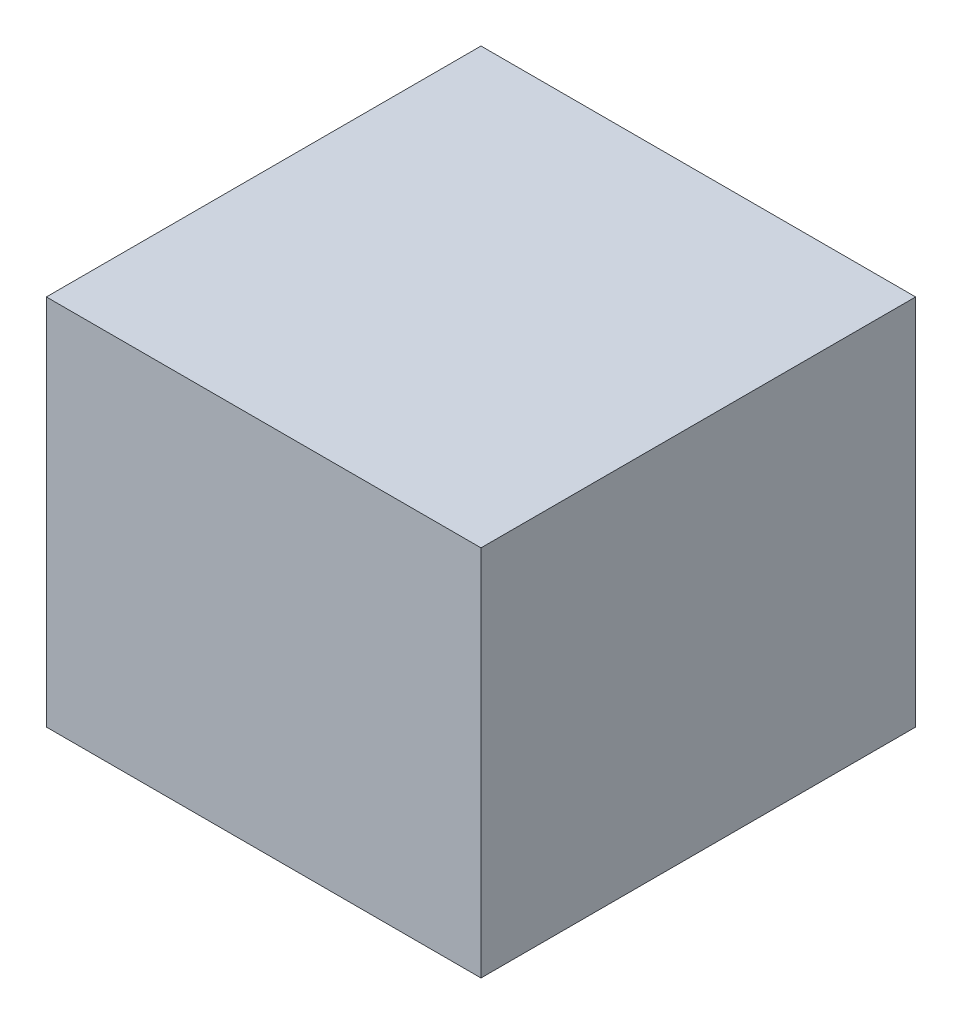
ISO-10303-21;
HEADER;
FILE_DESCRIPTION(('STEP AP214'),'2;1');
FILE_NAME('part.step','',(''),(''),'','','');
FILE_SCHEMA(('AUTOMOTIVE_DESIGN { 1 0 10303 214 1 1 1 1 }'));
ENDSEC;
DATA;
#1=APPLICATION_CONTEXT('core data for automotive mechanical design processes');
#2=APPLICATION_PROTOCOL_DEFINITION('international standard','automotive_design',2000,#1);
#3=PRODUCT_CONTEXT('',#1,'mechanical');
#4=PRODUCT('Part','Part','',(#3));
#5=PRODUCT_RELATED_PRODUCT_CATEGORY('part','',(#4));
#6=PRODUCT_DEFINITION_FORMATION('','',#4);
#7=PRODUCT_DEFINITION_CONTEXT('part definition',#1,'design');
#8=PRODUCT_DEFINITION('design','',#6,#7);
#9=PRODUCT_DEFINITION_SHAPE('','',#8);
#10=(LENGTH_UNIT() NAMED_UNIT(*) SI_UNIT(.MILLI.,.METRE.));
#11=(NAMED_UNIT(*) PLANE_ANGLE_UNIT() SI_UNIT($,.RADIAN.));
#12=(NAMED_UNIT(*) SI_UNIT($,.STERADIAN.) SOLID_ANGLE_UNIT());
#13=UNCERTAINTY_MEASURE_WITH_UNIT(LENGTH_MEASURE(1.E-05),#10,'distance_accuracy_value','');
#14=(GEOMETRIC_REPRESENTATION_CONTEXT(3) GLOBAL_UNCERTAINTY_ASSIGNED_CONTEXT((#13)) GLOBAL_UNIT_ASSIGNED_CONTEXT((#10,
#11,#12)) REPRESENTATION_CONTEXT('',''));
#15=CARTESIAN_POINT('',(0.,0.,0.));
#16=DIRECTION('',(0.,0.,1.));
#17=DIRECTION('',(1.,0.,0.));
#18=AXIS2_PLACEMENT_3D('',#15,#16,#17);
#19=CARTESIAN_POINT('',(-1.39999974,1.20000014,0.));
#20=DIRECTION('',(0.,1.,0.));
#21=DIRECTION('',(0.,0.,1.));
#22=AXIS2_PLACEMENT_3D('',#19,#20,#21);
#23=PLANE('',#22);
#24=DIRECTION('',(0.,0.,-1.));
#25=VECTOR('',#24,1.);
#26=CARTESIAN_POINT('',(1.39999974,1.20000014,0.));
#27=LINE('',#26,#25);
#28=CARTESIAN_POINT('',(1.39999974,1.20000014,0.));
#29=VERTEX_POINT('',#28);
#30=CARTESIAN_POINT('',(1.39999974,1.20000014,2.79999948));
#31=VERTEX_POINT('',#30);
#32=EDGE_CURVE('E20',#29,#31,#27,.F.);
#33=ORIENTED_EDGE('',*,*,#32,.F.);
#34=DIRECTION('',(1.,0.,0.));
#35=VECTOR('',#34,1.);
#36=CARTESIAN_POINT('',(1.39999974,1.20000014,0.));
#37=LINE('',#36,#35);
#38=CARTESIAN_POINT('',(-1.39999974,1.20000014,0.));
#39=VERTEX_POINT('',#38);
#40=EDGE_CURVE('E80',#29,#39,#37,.F.);
#41=ORIENTED_EDGE('',*,*,#40,.T.);
#42=DIRECTION('',(0.,0.,1.));
#43=VECTOR('',#42,1.);
#44=CARTESIAN_POINT('',(-1.39999974,1.20000014,0.));
#45=LINE('',#44,#43);
#46=CARTESIAN_POINT('',(-1.39999974,1.20000014,2.79999948));
#47=VERTEX_POINT('',#46);
#48=EDGE_CURVE('E68',#47,#39,#45,.F.);
#49=ORIENTED_EDGE('',*,*,#48,.F.);
#50=DIRECTION('',(1.,0.,0.));
#51=VECTOR('',#50,1.);
#52=CARTESIAN_POINT('',(1.39999974,1.20000014,2.79999948));
#53=LINE('',#52,#51);
#54=EDGE_CURVE('E56',#31,#47,#53,.F.);
#55=ORIENTED_EDGE('',*,*,#54,.F.);
#56=EDGE_LOOP('',(#33,#41,#49,#55));
#57=FACE_BOUND('',#56,.T.);
#58=ADVANCED_FACE('F17',(#57),#23,.T.);
#59=CARTESIAN_POINT('',(1.39999974,1.20000014,0.));
#60=DIRECTION('',(1.,0.,0.));
#61=DIRECTION('',(0.,0.,-1.));
#62=AXIS2_PLACEMENT_3D('',#59,#60,#61);
#63=PLANE('',#62);
#64=DIRECTION('',(0.,0.,-1.));
#65=VECTOR('',#64,1.);
#66=CARTESIAN_POINT('',(1.39999974,-1.20000014,0.));
#67=LINE('',#66,#65);
#68=CARTESIAN_POINT('',(1.39999974,-1.20000014,0.));
#69=VERTEX_POINT('',#68);
#70=CARTESIAN_POINT('',(1.39999974,-1.20000014,2.79999948));
#71=VERTEX_POINT('',#70);
#72=EDGE_CURVE('E83',#69,#71,#67,.F.);
#73=ORIENTED_EDGE('',*,*,#72,.F.);
#74=DIRECTION('',(0.,1.,0.));
#75=VECTOR('',#74,1.);
#76=CARTESIAN_POINT('',(1.39999974,-1.20000014,0.));
#77=LINE('',#76,#75);
#78=EDGE_CURVE('E65',#69,#29,#77,.T.);
#79=ORIENTED_EDGE('',*,*,#78,.T.);
#80=ORIENTED_EDGE('',*,*,#32,.T.);
#81=DIRECTION('',(0.,1.,0.));
#82=VECTOR('',#81,1.);
#83=CARTESIAN_POINT('',(1.39999974,-1.20000014,2.79999948));
#84=LINE('',#83,#82);
#85=EDGE_CURVE('E62',#71,#31,#84,.T.);
#86=ORIENTED_EDGE('',*,*,#85,.F.);
#87=EDGE_LOOP('',(#73,#79,#80,#86));
#88=FACE_BOUND('',#87,.T.);
#89=ADVANCED_FACE('F61',(#88),#63,.T.);
#90=CARTESIAN_POINT('',(1.39999974,-1.20000014,2.79999948));
#91=DIRECTION('',(0.,0.,1.));
#92=DIRECTION('',(1.,0.,0.));
#93=AXIS2_PLACEMENT_3D('',#90,#91,#92);
#94=PLANE('',#93);
#95=DIRECTION('',(0.,1.,0.));
#96=VECTOR('',#95,1.);
#97=CARTESIAN_POINT('',(-1.39999974,-1.20000014,2.79999948));
#98=LINE('',#97,#96);
#99=CARTESIAN_POINT('',(-1.39999974,-1.20000014,2.79999948));
#100=VERTEX_POINT('',#99);
#101=EDGE_CURVE('E70',#100,#47,#98,.T.);
#102=ORIENTED_EDGE('',*,*,#101,.F.);
#103=DIRECTION('',(1.,0.,0.));
#104=VECTOR('',#103,1.);
#105=CARTESIAN_POINT('',(1.39999974,-1.20000014,2.79999948));
#106=LINE('',#105,#104);
#107=EDGE_CURVE('E74',#71,#100,#106,.F.);
#108=ORIENTED_EDGE('',*,*,#107,.F.);
#109=ORIENTED_EDGE('',*,*,#85,.T.);
#110=ORIENTED_EDGE('',*,*,#54,.T.);
#111=EDGE_LOOP('',(#102,#108,#109,#110));
#112=FACE_BOUND('',#111,.T.);
#113=ADVANCED_FACE('F72',(#112),#94,.T.);
#114=CARTESIAN_POINT('',(-1.39999974,-1.20000014,0.));
#115=DIRECTION('',(-1.,0.,0.));
#116=DIRECTION('',(0.,0.,1.));
#117=AXIS2_PLACEMENT_3D('',#114,#115,#116);
#118=PLANE('',#117);
#119=ORIENTED_EDGE('',*,*,#48,.T.);
#120=DIRECTION('',(0.,1.,0.));
#121=VECTOR('',#120,1.);
#122=CARTESIAN_POINT('',(-1.39999974,-1.20000014,0.));
#123=LINE('',#122,#121);
#124=CARTESIAN_POINT('',(-1.39999974,-1.20000014,0.));
#125=VERTEX_POINT('',#124);
#126=EDGE_CURVE('E35',#39,#125,#123,.F.);
#127=ORIENTED_EDGE('',*,*,#126,.T.);
#128=DIRECTION('',(0.,0.,-1.));
#129=VECTOR('',#128,1.);
#130=CARTESIAN_POINT('',(-1.39999974,-1.20000014,0.));
#131=LINE('',#130,#129);
#132=EDGE_CURVE('E26',#100,#125,#131,.T.);
#133=ORIENTED_EDGE('',*,*,#132,.F.);
#134=ORIENTED_EDGE('',*,*,#101,.T.);
#135=EDGE_LOOP('',(#119,#127,#133,#134));
#136=FACE_BOUND('',#135,.T.);
#137=ADVANCED_FACE('F89',(#136),#118,.T.);
#138=CARTESIAN_POINT('',(1.39999974,-1.20000014,0.));
#139=DIRECTION('',(0.,0.,1.));
#140=DIRECTION('',(1.,0.,0.));
#141=AXIS2_PLACEMENT_3D('',#138,#139,#140);
#142=PLANE('',#141);
#143=ORIENTED_EDGE('',*,*,#126,.F.);
#144=ORIENTED_EDGE('',*,*,#40,.F.);
#145=ORIENTED_EDGE('',*,*,#78,.F.);
#146=DIRECTION('',(1.,0.,0.));
#147=VECTOR('',#146,1.);
#148=CARTESIAN_POINT('',(1.39999974,-1.20000014,0.));
#149=LINE('',#148,#147);
#150=EDGE_CURVE('E11',#125,#69,#149,.T.);
#151=ORIENTED_EDGE('',*,*,#150,.F.);
#152=EDGE_LOOP('',(#143,#144,#145,#151));
#153=FACE_BOUND('',#152,.T.);
#154=ADVANCED_FACE('F91',(#153),#142,.F.);
#155=CARTESIAN_POINT('',(1.39999974,-1.20000014,0.));
#156=DIRECTION('',(0.,-1.,0.));
#157=DIRECTION('',(0.,0.,-1.));
#158=AXIS2_PLACEMENT_3D('',#155,#156,#157);
#159=PLANE('',#158);
#160=ORIENTED_EDGE('',*,*,#132,.T.);
#161=ORIENTED_EDGE('',*,*,#150,.T.);
#162=ORIENTED_EDGE('',*,*,#72,.T.);
#163=ORIENTED_EDGE('',*,*,#107,.T.);
#164=EDGE_LOOP('',(#160,#161,#162,#163));
#165=FACE_BOUND('',#164,.T.);
#166=ADVANCED_FACE('F88',(#165),#159,.T.);
#167=CLOSED_SHELL('',(#58,#89,#113,#137,#154,#166));
#168=MANIFOLD_SOLID_BREP('B1',#167);
#169=ADVANCED_BREP_SHAPE_REPRESENTATION('',(#18,#168),#14);
#170=SHAPE_DEFINITION_REPRESENTATION(#9,#169);
ENDSEC;
END-ISO-10303-21;
